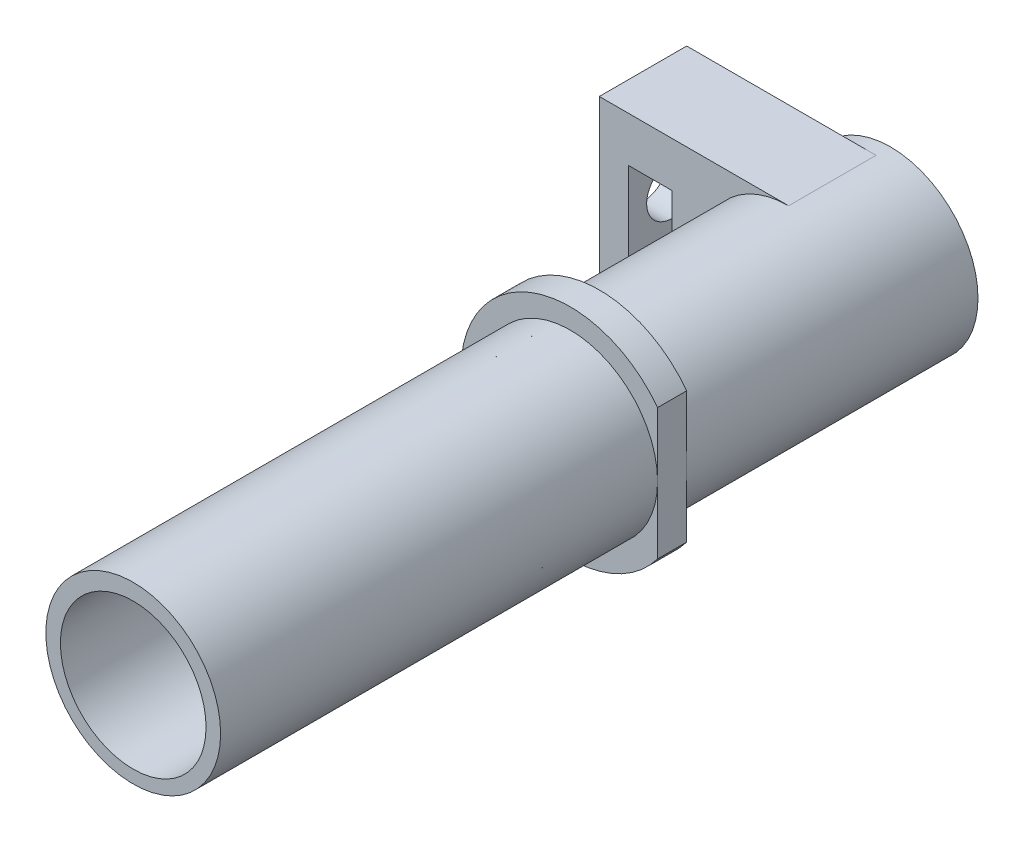
ISO-10303-21;
HEADER;
FILE_DESCRIPTION(('STEP AP214'),'2;1');
FILE_NAME('part.step','',(''),(''),'','','');
FILE_SCHEMA(('AUTOMOTIVE_DESIGN { 1 0 10303 214 1 1 1 1 }'));
ENDSEC;
DATA;
#1=APPLICATION_CONTEXT('core data for automotive mechanical design processes');
#2=APPLICATION_PROTOCOL_DEFINITION('international standard','automotive_design',2000,#1);
#3=PRODUCT_CONTEXT('',#1,'mechanical');
#4=PRODUCT('Part','Part','',(#3));
#5=PRODUCT_RELATED_PRODUCT_CATEGORY('part','',(#4));
#6=PRODUCT_DEFINITION_FORMATION('','',#4);
#7=PRODUCT_DEFINITION_CONTEXT('part definition',#1,'design');
#8=PRODUCT_DEFINITION('design','',#6,#7);
#9=PRODUCT_DEFINITION_SHAPE('','',#8);
#10=(LENGTH_UNIT() NAMED_UNIT(*) SI_UNIT(.MILLI.,.METRE.));
#11=(NAMED_UNIT(*) PLANE_ANGLE_UNIT() SI_UNIT($,.RADIAN.));
#12=(NAMED_UNIT(*) SI_UNIT($,.STERADIAN.) SOLID_ANGLE_UNIT());
#13=UNCERTAINTY_MEASURE_WITH_UNIT(LENGTH_MEASURE(1.E-05),#10,'distance_accuracy_value','');
#14=(GEOMETRIC_REPRESENTATION_CONTEXT(3) GLOBAL_UNCERTAINTY_ASSIGNED_CONTEXT((#13)) GLOBAL_UNIT_ASSIGNED_CONTEXT((#10,
#11,#12)) REPRESENTATION_CONTEXT('',''));
#15=CARTESIAN_POINT('',(0.,0.,0.));
#16=DIRECTION('',(0.,0.,1.));
#17=DIRECTION('',(1.,0.,0.));
#18=AXIS2_PLACEMENT_3D('',#15,#16,#17);
#19=CARTESIAN_POINT('',(3.,0.,-16.));
#20=DIRECTION('',(-1.,0.,0.));
#21=DIRECTION('',(0.,-1.,0.));
#22=AXIS2_PLACEMENT_3D('',#19,#20,#21);
#23=CYLINDRICAL_SURFACE('',#22,1.75);
#24=CARTESIAN_POINT('',(-11.,0.,-16.));
#25=DIRECTION('',(-1.,0.,0.));
#26=DIRECTION('',(0.,0.,1.));
#27=AXIS2_PLACEMENT_3D('',#24,#25,#26);
#28=CIRCLE('',#27,1.75);
#29=CARTESIAN_POINT('',(-11.,0.,-14.25));
#30=VERTEX_POINT('',#29);
#31=EDGE_CURVE('E44',#30,#30,#28,.F.);
#32=ORIENTED_EDGE('',*,*,#31,.T.);
#33=EDGE_LOOP('',(#32));
#34=FACE_BOUND('',#33,.T.);
#35=CARTESIAN_POINT('',(-13.,0.,-16.));
#36=DIRECTION('',(-1.,0.,0.));
#37=DIRECTION('',(0.,-1.,0.));
#38=AXIS2_PLACEMENT_3D('',#35,#36,#37);
#39=CIRCLE('',#38,1.75);
#40=CARTESIAN_POINT('',(-13.,-1.75,-16.));
#41=VERTEX_POINT('',#40);
#42=EDGE_CURVE('E168',#41,#41,#39,.T.);
#43=ORIENTED_EDGE('',*,*,#42,.T.);
#44=EDGE_LOOP('',(#43));
#45=FACE_BOUND('',#44,.T.);
#46=ADVANCED_FACE('F40',(#34,#45),#23,.F.);
#47=CARTESIAN_POINT('',(0.,0.,0.));
#48=DIRECTION('',(0.,0.,1.));
#49=DIRECTION('',(1.,0.,0.));
#50=AXIS2_PLACEMENT_3D('',#47,#48,#49);
#51=PLANE('',#50);
#52=CARTESIAN_POINT('',(0.,0.,0.));
#53=DIRECTION('',(0.,0.,1.));
#54=DIRECTION('',(1.,0.,0.));
#55=AXIS2_PLACEMENT_3D('',#52,#53,#54);
#56=CIRCLE('',#55,7.5);
#57=CARTESIAN_POINT('',(6.,4.5,0.));
#58=VERTEX_POINT('',#57);
#59=CARTESIAN_POINT('',(6.,-4.5,0.));
#60=VERTEX_POINT('',#59);
#61=EDGE_CURVE('E321',#58,#60,#56,.T.);
#62=ORIENTED_EDGE('',*,*,#61,.F.);
#63=DIRECTION('',(0.,1.,0.));
#64=VECTOR('',#63,1.);
#65=CARTESIAN_POINT('',(6.,4.5,0.));
#66=LINE('',#65,#64);
#67=CARTESIAN_POINT('',(6.,0.,0.));
#68=VERTEX_POINT('',#67);
#69=EDGE_CURVE('E289',#68,#58,#66,.T.);
#70=ORIENTED_EDGE('',*,*,#69,.F.);
#71=CARTESIAN_POINT('',(0.,0.,0.));
#72=DIRECTION('',(0.,0.,1.));
#73=DIRECTION('',(1.,0.,0.));
#74=AXIS2_PLACEMENT_3D('',#71,#72,#73);
#75=CIRCLE('',#74,6.);
#76=EDGE_CURVE('E11',#68,#68,#75,.F.);
#77=ORIENTED_EDGE('',*,*,#76,.F.);
#78=EDGE_CURVE('E290',#60,#68,#66,.T.);
#79=ORIENTED_EDGE('',*,*,#78,.F.);
#80=EDGE_LOOP('',(#62,#70,#77,#79));
#81=FACE_BOUND('',#80,.T.);
#82=ADVANCED_FACE('F236',(#81),#51,.F.);
#83=CARTESIAN_POINT('',(0.,0.,2.));
#84=DIRECTION('',(0.,0.,1.));
#85=DIRECTION('',(1.,0.,0.));
#86=AXIS2_PLACEMENT_3D('',#83,#84,#85);
#87=PLANE('',#86);
#88=DIRECTION('',(0.,-1.,0.));
#89=VECTOR('',#88,1.);
#90=CARTESIAN_POINT('',(6.,0.,2.));
#91=LINE('',#90,#89);
#92=CARTESIAN_POINT('',(6.,4.5,2.));
#93=VERTEX_POINT('',#92);
#94=CARTESIAN_POINT('',(6.,0.114284202410885,2.));
#95=VERTEX_POINT('',#94);
#96=EDGE_CURVE('E303',#93,#95,#91,.T.);
#97=ORIENTED_EDGE('',*,*,#96,.F.);
#98=CARTESIAN_POINT('',(0.,0.,2.));
#99=DIRECTION('',(0.,0.,1.));
#100=DIRECTION('',(1.,0.,0.));
#101=AXIS2_PLACEMENT_3D('',#98,#99,#100);
#102=CIRCLE('',#101,7.5);
#103=CARTESIAN_POINT('',(6.,-4.5,2.));
#104=VERTEX_POINT('',#103);
#105=EDGE_CURVE('E50',#93,#104,#102,.T.);
#106=ORIENTED_EDGE('',*,*,#105,.T.);
#107=EDGE_CURVE('E298',#95,#104,#91,.T.);
#108=ORIENTED_EDGE('',*,*,#107,.F.);
#109=CARTESIAN_POINT('',(0.,0.114284202410886,2.));
#110=DIRECTION('',(0.,0.,1.));
#111=DIRECTION('',(1.,0.,0.));
#112=AXIS2_PLACEMENT_3D('',#109,#110,#111);
#113=CIRCLE('',#112,6.);
#114=EDGE_CURVE('E316',#95,#95,#113,.T.);
#115=ORIENTED_EDGE('',*,*,#114,.F.);
#116=EDGE_LOOP('',(#97,#106,#108,#115));
#117=FACE_BOUND('',#116,.T.);
#118=ADVANCED_FACE('F241',(#117),#87,.T.);
#119=CARTESIAN_POINT('',(0.,0.,2.));
#120=DIRECTION('',(0.,0.,-1.));
#121=DIRECTION('',(-1.,0.,0.));
#122=AXIS2_PLACEMENT_3D('',#119,#120,#121);
#123=CYLINDRICAL_SURFACE('',#122,7.5);
#124=ORIENTED_EDGE('',*,*,#105,.F.);
#125=DIRECTION('',(0.,0.,-1.));
#126=VECTOR('',#125,1.);
#127=CARTESIAN_POINT('',(6.,4.5,32.));
#128=LINE('',#127,#126);
#129=EDGE_CURVE('E294',#93,#58,#128,.T.);
#130=ORIENTED_EDGE('',*,*,#129,.T.);
#131=ORIENTED_EDGE('',*,*,#61,.T.);
#132=DIRECTION('',(0.,0.,-1.));
#133=VECTOR('',#132,1.);
#134=CARTESIAN_POINT('',(6.,-4.5,32.));
#135=LINE('',#134,#133);
#136=EDGE_CURVE('E293',#104,#60,#135,.T.);
#137=ORIENTED_EDGE('',*,*,#136,.F.);
#138=EDGE_LOOP('',(#124,#130,#131,#137));
#139=FACE_BOUND('',#138,.T.);
#140=ADVANCED_FACE('F42',(#139),#123,.T.);
#141=CARTESIAN_POINT('',(0.,0.,2.));
#142=DIRECTION('',(0.,0.,-1.));
#143=DIRECTION('',(-1.,0.,0.));
#144=AXIS2_PLACEMENT_3D('',#141,#142,#143);
#145=CYLINDRICAL_SURFACE('',#144,5.);
#146=CARTESIAN_POINT('',(-5.,0.,-14.25));
#147=CARTESIAN_POINT('',(-5.00000103733101,-0.0952096828338517,-14.2499985216753));
#148=CARTESIAN_POINT('',(-4.99725598893572,-0.19040881080287,-14.2577948357027));
#149=CARTESIAN_POINT('',(-4.98657727125096,-0.377986679584454,-14.2886668965811));
#150=CARTESIAN_POINT('',(-4.97864357880525,-0.470365407808016,-14.3117427116226));
#151=CARTESIAN_POINT('',(-4.95844563461182,-0.649571178008045,-14.372274469251));
#152=CARTESIAN_POINT('',(-4.94618906431992,-0.736407746879042,-14.4097049148862));
#153=CARTESIAN_POINT('',(-4.91858449865725,-0.90256832264742,-14.497762555632));
#154=CARTESIAN_POINT('',(-4.90323580073971,-0.981890616231569,-14.5483927505616));
#155=CARTESIAN_POINT('',(-4.87040308680158,-1.13376294602663,-14.6634142578254));
#156=CARTESIAN_POINT('',(-4.85286420888526,-1.2059909823802,-14.7282149591112));
#157=CARTESIAN_POINT('',(-4.81791697471987,-1.3388059257563,-14.8688683344737));
#158=CARTESIAN_POINT('',(-4.80050865235984,-1.39938990436505,-14.9447237803435));
#159=CARTESIAN_POINT('',(-4.76717677106639,-1.50911478218042,-15.1083273247793));
#160=CARTESIAN_POINT('',(-4.75131928060129,-1.5578231653081,-15.1963802792296));
#161=CARTESIAN_POINT('',(-4.72372622172788,-1.63959966142256,-15.3800722951456));
#162=CARTESIAN_POINT('',(-4.71198924734498,-1.67267311059309,-15.475708755338));
#163=CARTESIAN_POINT('',(-4.69454718177247,-1.72100819663792,-15.6681715163408));
#164=CARTESIAN_POINT('',(-4.68863691368676,-1.73687783577275,-15.7648259485681));
#165=CARTESIAN_POINT('',(-4.68291285938438,-1.75225598886936,-15.9595925594599));
#166=CARTESIAN_POINT('',(-4.68309695465922,-1.75177018827031,-16.057704219712));
#167=CARTESIAN_POINT('',(-4.68936213420266,-1.73492049950347,-16.2472747294413));
#168=CARTESIAN_POINT('',(-4.69514165218839,-1.71936857551242,-16.3388174901404));
#169=CARTESIAN_POINT('',(-4.71145002275453,-1.67415954156167,-16.5179012031455));
#170=CARTESIAN_POINT('',(-4.72197949914485,-1.64450057890303,-16.6054416281629));
#171=CARTESIAN_POINT('',(-4.74680305355679,-1.57142185546169,-16.7758061833894));
#172=CARTESIAN_POINT('',(-4.76115899627831,-1.52777332723189,-16.8585227756742));
#173=CARTESIAN_POINT('',(-4.79199406442834,-1.4281134425151,-17.0157059744924));
#174=CARTESIAN_POINT('',(-4.80847385131419,-1.37209823061347,-17.090169997322));
#175=CARTESIAN_POINT('',(-4.84286620656224,-1.24546699759313,-17.2332716141847));
#176=CARTESIAN_POINT('',(-4.86080646622104,-1.17419303921033,-17.3013216247744));
#177=CARTESIAN_POINT('',(-4.8952687040212,-1.0210284236278,-17.4246649359445));
#178=CARTESIAN_POINT('',(-4.91179051664925,-0.939136530251654,-17.4799567490853));
#179=CARTESIAN_POINT('',(-4.94181156683104,-0.765717364559243,-17.5767529956271));
#180=CARTESIAN_POINT('',(-4.95527243997278,-0.674086901705204,-17.6180852812226));
#181=CARTESIAN_POINT('',(-4.97737441176816,-0.484587571487144,-17.6845611534333));
#182=CARTESIAN_POINT('',(-4.98601736398459,-0.386721119418453,-17.7097109663858));
#183=CARTESIAN_POINT('',(-4.99719530081429,-0.19249102184071,-17.7420329067109));
#184=CARTESIAN_POINT('',(-4.99999944582713,-0.0962746493135024,-17.7499979032595));
#185=CARTESIAN_POINT('',(-5.00000055348245,0.0961482432192141,-17.750002094671));
#186=CARTESIAN_POINT('',(-4.99719857404261,0.192354761658124,-17.7420442942851));
#187=CARTESIAN_POINT('',(-4.98648016160199,0.378756147356785,-17.7110473250482));
#188=CARTESIAN_POINT('',(-4.97873315412155,0.469044763699439,-17.6885074311332));
#189=CARTESIAN_POINT('',(-4.95907295054626,0.64451252208843,-17.6296230925497));
#190=CARTESIAN_POINT('',(-4.94715921538899,0.729691001349328,-17.5932768616604));
#191=CARTESIAN_POINT('',(-4.91995212643839,0.895153397302998,-17.5067049556843));
#192=CARTESIAN_POINT('',(-4.90457436715764,0.975236620637246,-17.4561230076482));
#193=CARTESIAN_POINT('',(-4.87216758733509,1.12602889379182,-17.3429274102134));
#194=CARTESIAN_POINT('',(-4.85513801945205,1.19673481786299,-17.280309765888));
#195=CARTESIAN_POINT('',(-4.82025419862104,1.33047657690196,-17.141099899193));
#196=CARTESIAN_POINT('',(-4.80240157790623,1.39294725580895,-17.0639629460116));
#197=CARTESIAN_POINT('',(-4.76874589345347,1.50414371312864,-16.8999270503001));
#198=CARTESIAN_POINT('',(-4.75294290163694,1.55286900928668,-16.8130277654096));
#199=CARTESIAN_POINT('',(-4.72530277474736,1.63505490739624,-16.6316663548963));
#200=CARTESIAN_POINT('',(-4.71346572039381,1.66851519866113,-16.5372040753908));
#201=CARTESIAN_POINT('',(-4.69533771032375,1.71887583093725,-16.3434672730568));
#202=CARTESIAN_POINT('',(-4.68904390901757,1.73578466901695,-16.2441952469234));
#203=CARTESIAN_POINT('',(-4.68306030518287,1.75185969647853,-16.0496898392289));
#204=CARTESIAN_POINT('',(-4.68301773400572,1.7519736539037,-15.9545448516573));
#205=CARTESIAN_POINT('',(-4.68865663417064,1.73682550011427,-15.7656686884212));
#206=CARTESIAN_POINT('',(-4.69433769425176,1.72156449363927,-15.6719374116682));
#207=CARTESIAN_POINT('',(-4.71050847004451,1.67679826569238,-15.4907245206286));
#208=CARTESIAN_POINT('',(-4.72088397271024,1.64763052861044,-15.4031485166598));
#209=CARTESIAN_POINT('',(-4.74522244831082,1.57616059789321,-15.2340709525965));
#210=CARTESIAN_POINT('',(-4.7591862653351,1.53385531338635,-15.1525708275759));
#211=CARTESIAN_POINT('',(-4.78994937845571,1.43498510349303,-14.9937827123039));
#212=CARTESIAN_POINT('',(-4.80685142496673,1.37784120361852,-14.9168752998993));
#213=CARTESIAN_POINT('',(-4.84118780733322,1.25186200567032,-14.7734361856582));
#214=CARTESIAN_POINT('',(-4.85862229965653,1.18302324322024,-14.706907569574));
#215=CARTESIAN_POINT('',(-4.8929933476359,1.0319265825184,-14.583108109143));
#216=CARTESIAN_POINT('',(-4.90987297784856,0.949206989314116,-14.5263827747453));
#217=CARTESIAN_POINT('',(-4.94039013085785,0.774833814541663,-14.4276882523602));
#218=CARTESIAN_POINT('',(-4.95402808296839,0.683181418264973,-14.3857171100381));
#219=CARTESIAN_POINT('',(-4.97638140508249,0.4945149188633,-14.3183713904794));
#220=CARTESIAN_POINT('',(-4.9851485754033,0.397569773126585,-14.292821695715));
#221=CARTESIAN_POINT('',(-4.9969563185802,0.200411745802667,-14.2586397574974));
#222=CARTESIAN_POINT('',(-4.99999890829805,0.100200027745055,-14.25000155581));
#223=CARTESIAN_POINT('',(-5.,0.,-14.25));
#224=B_SPLINE_CURVE_WITH_KNOTS('',3,(#146,#147,#148,#149,#150,#151,#152,#153,#154,#155,#156,
#157,#158,#159,#160,#161,#162,#163,#164,#165,#166,#167,#168,#169,#170,#171,#172,#173,#174,#175,
#176,#177,#178,#179,#180,#181,#182,#183,#184,#185,#186,#187,#188,#189,#190,#191,#192,#193,#194,
#195,#196,#197,#198,#199,#200,#201,#202,#203,#204,#205,#206,#207,#208,#209,#210,#211,#212,#213,
#214,#215,#216,#217,#218,#219,#220,#221,#222,#223),.UNSPECIFIED.,.T.,.F.,(4,2,2,2,2,2,2,2,2,2,2,
2,2,2,2,2,2,2,2,2,2,2,2,2,2,2,2,2,2,2,2,2,2,2,2,2,2,2,4),(0.,0.285259972015709,
0.570521217118272,0.855278105441005,1.14009976506063,1.43460645051474,1.72918710607093,
2.03327692240217,2.33726287818893,2.63011516958154,2.92286566140676,3.20066900267533,
3.4785088383591,3.76114618999298,4.0438717808712,4.34297890688594,4.64212088729939,
4.94482757119952,5.24741771649683,5.535718777151,5.82396543836598,6.10283068551592,
6.38173202367696,6.66835188854305,6.95506705399024,7.25621287816636,7.55736926668414,
7.85853178432477,8.15953961206051,8.44355407895973,8.7275481399799,9.0049762467923,
9.28246967364509,9.57306535444324,9.86374726916317,10.1673989020176,10.4710102981225,
10.7713277865075,11.0715394483866),.UNSPECIFIED.);
#225=CARTESIAN_POINT('',(-5.,0.,-14.25));
#226=VERTEX_POINT('',#225);
#227=EDGE_CURVE('E172',#226,#226,#224,.T.);
#228=ORIENTED_EDGE('',*,*,#227,.F.);
#229=EDGE_LOOP('',(#228));
#230=FACE_BOUND('',#229,.T.);
#231=CARTESIAN_POINT('',(0.,0.,32.));
#232=DIRECTION('',(0.,0.,1.));
#233=DIRECTION('',(1.,0.,0.));
#234=AXIS2_PLACEMENT_3D('',#231,#232,#233);
#235=CIRCLE('',#234,5.);
#236=CARTESIAN_POINT('',(5.,0.,32.));
#237=VERTEX_POINT('',#236);
#238=EDGE_CURVE('E312',#237,#237,#235,.T.);
#239=ORIENTED_EDGE('',*,*,#238,.T.);
#240=EDGE_LOOP('',(#239));
#241=FACE_BOUND('',#240,.T.);
#242=CARTESIAN_POINT('',(0.,0.,-20.));
#243=DIRECTION('',(0.,0.,-1.));
#244=DIRECTION('',(-1.,0.,0.));
#245=AXIS2_PLACEMENT_3D('',#242,#243,#244);
#246=CIRCLE('',#245,5.);
#247=CARTESIAN_POINT('',(-5.,0.,-20.));
#248=VERTEX_POINT('',#247);
#249=EDGE_CURVE('E304',#248,#248,#246,.T.);
#250=ORIENTED_EDGE('',*,*,#249,.T.);
#251=EDGE_LOOP('',(#250));
#252=FACE_BOUND('',#251,.T.);
#253=ADVANCED_FACE('F183',(#230,#241,#252),#145,.F.);
#254=CARTESIAN_POINT('',(0.,0.114284202410886,32.));
#255=DIRECTION('',(0.,0.,1.));
#256=DIRECTION('',(1.,0.,0.));
#257=AXIS2_PLACEMENT_3D('',#254,#255,#256);
#258=PLANE('',#257);
#259=CARTESIAN_POINT('',(0.,0.114284202410886,32.));
#260=DIRECTION('',(0.,0.,1.));
#261=DIRECTION('',(1.,0.,0.));
#262=AXIS2_PLACEMENT_3D('',#259,#260,#261);
#263=CIRCLE('',#262,6.);
#264=CARTESIAN_POINT('',(6.,0.114284202410886,32.));
#265=VERTEX_POINT('',#264);
#266=EDGE_CURVE('E317',#265,#265,#263,.T.);
#267=ORIENTED_EDGE('',*,*,#266,.T.);
#268=EDGE_LOOP('',(#267));
#269=FACE_BOUND('',#268,.T.);
#270=ORIENTED_EDGE('',*,*,#238,.F.);
#271=EDGE_LOOP('',(#270));
#272=FACE_BOUND('',#271,.T.);
#273=ADVANCED_FACE('F226',(#269,#272),#258,.T.);
#274=CARTESIAN_POINT('',(0.,0.114284202410886,32.));
#275=DIRECTION('',(0.,0.,-1.));
#276=DIRECTION('',(-1.,0.,0.));
#277=AXIS2_PLACEMENT_3D('',#274,#275,#276);
#278=CYLINDRICAL_SURFACE('',#277,6.);
#279=ORIENTED_EDGE('',*,*,#114,.T.);
#280=EDGE_LOOP('',(#279));
#281=FACE_BOUND('',#280,.T.);
#282=ORIENTED_EDGE('',*,*,#266,.F.);
#283=EDGE_LOOP('',(#282));
#284=FACE_BOUND('',#283,.T.);
#285=ADVANCED_FACE('F221',(#281,#284),#278,.T.);
#286=CARTESIAN_POINT('',(0.,0.,-20.));
#287=DIRECTION('',(0.,0.,-1.));
#288=DIRECTION('',(-1.,0.,0.));
#289=AXIS2_PLACEMENT_3D('',#286,#287,#288);
#290=PLANE('',#289);
#291=CARTESIAN_POINT('',(0.,0.,-20.));
#292=DIRECTION('',(0.,0.,-1.));
#293=DIRECTION('',(-1.,0.,0.));
#294=AXIS2_PLACEMENT_3D('',#291,#292,#293);
#295=CIRCLE('',#294,6.);
#296=CARTESIAN_POINT('',(-6.,0.,-20.));
#297=VERTEX_POINT('',#296);
#298=EDGE_CURVE('E308',#297,#297,#295,.T.);
#299=ORIENTED_EDGE('',*,*,#298,.T.);
#300=EDGE_LOOP('',(#299));
#301=FACE_BOUND('',#300,.T.);
#302=ORIENTED_EDGE('',*,*,#249,.F.);
#303=EDGE_LOOP('',(#302));
#304=FACE_BOUND('',#303,.T.);
#305=ADVANCED_FACE('F218',(#301,#304),#290,.T.);
#306=CARTESIAN_POINT('',(0.,0.,-20.));
#307=DIRECTION('',(0.,0.,1.));
#308=DIRECTION('',(1.,0.,0.));
#309=AXIS2_PLACEMENT_3D('',#306,#307,#308);
#310=CYLINDRICAL_SURFACE('',#309,6.);
#311=DIRECTION('',(0.,0.,1.));
#312=VECTOR('',#311,1.);
#313=CARTESIAN_POINT('',(0.,-6.,-19.));
#314=LINE('',#313,#312);
#315=CARTESIAN_POINT('',(0.,-6.,-19.));
#316=VERTEX_POINT('',#315);
#317=CARTESIAN_POINT('',(0.,-6.,-13.));
#318=VERTEX_POINT('',#317);
#319=EDGE_CURVE('E285',#316,#318,#314,.T.);
#320=ORIENTED_EDGE('',*,*,#319,.F.);
#321=CARTESIAN_POINT('',(0.,0.,-19.));
#322=DIRECTION('',(0.,0.,1.));
#323=DIRECTION('',(-1.,0.,0.));
#324=AXIS2_PLACEMENT_3D('',#321,#322,#323);
#325=CIRCLE('',#324,6.);
#326=CARTESIAN_POINT('',(0.,6.,-19.));
#327=VERTEX_POINT('',#326);
#328=EDGE_CURVE('E181',#327,#316,#325,.T.);
#329=ORIENTED_EDGE('',*,*,#328,.F.);
#330=DIRECTION('',(0.,0.,1.));
#331=VECTOR('',#330,1.);
#332=CARTESIAN_POINT('',(0.,6.,-19.));
#333=LINE('',#332,#331);
#334=CARTESIAN_POINT('',(0.,6.,-13.));
#335=VERTEX_POINT('',#334);
#336=EDGE_CURVE('E271',#327,#335,#333,.T.);
#337=ORIENTED_EDGE('',*,*,#336,.T.);
#338=CARTESIAN_POINT('',(0.,0.,-13.));
#339=DIRECTION('',(0.,0.,1.));
#340=DIRECTION('',(-1.,0.,0.));
#341=AXIS2_PLACEMENT_3D('',#338,#339,#340);
#342=CIRCLE('',#341,6.);
#343=EDGE_CURVE('E180',#335,#318,#342,.T.);
#344=ORIENTED_EDGE('',*,*,#343,.T.);
#345=EDGE_LOOP('',(#320,#329,#337,#344));
#346=FACE_BOUND('',#345,.T.);
#347=ORIENTED_EDGE('',*,*,#298,.F.);
#348=EDGE_LOOP('',(#347));
#349=FACE_BOUND('',#348,.T.);
#350=ORIENTED_EDGE('',*,*,#76,.T.);
#351=EDGE_LOOP('',(#350));
#352=FACE_BOUND('',#351,.T.);
#353=ADVANCED_FACE('F216',(#346,#349,#352),#310,.T.);
#354=CARTESIAN_POINT('',(6.,4.5,32.));
#355=DIRECTION('',(-1.,0.,0.));
#356=DIRECTION('',(0.,-1.,0.));
#357=AXIS2_PLACEMENT_3D('',#354,#355,#356);
#358=PLANE('',#357);
#359=ORIENTED_EDGE('',*,*,#96,.T.);
#360=ORIENTED_EDGE('',*,*,#107,.T.);
#361=ORIENTED_EDGE('',*,*,#136,.T.);
#362=ORIENTED_EDGE('',*,*,#78,.T.);
#363=ORIENTED_EDGE('',*,*,#69,.T.);
#364=ORIENTED_EDGE('',*,*,#129,.F.);
#365=EDGE_LOOP('',(#359,#360,#361,#362,#363,#364));
#366=FACE_BOUND('',#365,.T.);
#367=ADVANCED_FACE('F212',(#366),#358,.F.);
#368=CARTESIAN_POINT('',(-13.,-6.,-19.));
#369=DIRECTION('',(0.,1.,0.));
#370=DIRECTION('',(-1.,0.,0.));
#371=AXIS2_PLACEMENT_3D('',#368,#369,#370);
#372=PLANE('',#371);
#373=DIRECTION('',(-1.,0.,0.));
#374=VECTOR('',#373,1.);
#375=CARTESIAN_POINT('',(-13.,-6.,-13.));
#376=LINE('',#375,#374);
#377=CARTESIAN_POINT('',(-13.,-6.,-13.));
#378=VERTEX_POINT('',#377);
#379=EDGE_CURVE('E263',#318,#378,#376,.T.);
#380=ORIENTED_EDGE('',*,*,#379,.T.);
#381=DIRECTION('',(0.,0.,1.));
#382=VECTOR('',#381,1.);
#383=CARTESIAN_POINT('',(-13.,-6.,-19.));
#384=LINE('',#383,#382);
#385=CARTESIAN_POINT('',(-13.,-6.,-19.));
#386=VERTEX_POINT('',#385);
#387=EDGE_CURVE('E257',#386,#378,#384,.T.);
#388=ORIENTED_EDGE('',*,*,#387,.F.);
#389=DIRECTION('',(-1.,0.,0.));
#390=VECTOR('',#389,1.);
#391=CARTESIAN_POINT('',(-13.,-6.,-19.));
#392=LINE('',#391,#390);
#393=EDGE_CURVE('E278',#316,#386,#392,.T.);
#394=ORIENTED_EDGE('',*,*,#393,.F.);
#395=ORIENTED_EDGE('',*,*,#319,.T.);
#396=EDGE_LOOP('',(#380,#388,#394,#395));
#397=FACE_BOUND('',#396,.T.);
#398=ADVANCED_FACE('F208',(#397),#372,.F.);
#399=CARTESIAN_POINT('',(-13.,6.,-19.));
#400=DIRECTION('',(1.,0.,0.));
#401=DIRECTION('',(0.,1.,0.));
#402=AXIS2_PLACEMENT_3D('',#399,#400,#401);
#403=PLANE('',#402);
#404=ORIENTED_EDGE('',*,*,#42,.F.);
#405=EDGE_LOOP('',(#404));
#406=FACE_BOUND('',#405,.T.);
#407=DIRECTION('',(0.,1.,0.));
#408=VECTOR('',#407,1.);
#409=CARTESIAN_POINT('',(-13.,6.,-13.));
#410=LINE('',#409,#408);
#411=CARTESIAN_POINT('',(-13.,6.,-13.));
#412=VERTEX_POINT('',#411);
#413=EDGE_CURVE('E251',#378,#412,#410,.T.);
#414=ORIENTED_EDGE('',*,*,#413,.T.);
#415=DIRECTION('',(0.,0.,1.));
#416=VECTOR('',#415,1.);
#417=CARTESIAN_POINT('',(-13.,6.,-19.));
#418=LINE('',#417,#416);
#419=CARTESIAN_POINT('',(-13.,6.,-19.));
#420=VERTEX_POINT('',#419);
#421=EDGE_CURVE('E254',#420,#412,#418,.T.);
#422=ORIENTED_EDGE('',*,*,#421,.F.);
#423=DIRECTION('',(0.,1.,0.));
#424=VECTOR('',#423,1.);
#425=CARTESIAN_POINT('',(-13.,6.,-19.));
#426=LINE('',#425,#424);
#427=EDGE_CURVE('E360',#386,#420,#426,.T.);
#428=ORIENTED_EDGE('',*,*,#427,.F.);
#429=ORIENTED_EDGE('',*,*,#387,.T.);
#430=EDGE_LOOP('',(#414,#422,#428,#429));
#431=FACE_BOUND('',#430,.T.);
#432=ADVANCED_FACE('F204',(#406,#431),#403,.F.);
#433=CARTESIAN_POINT('',(0.,6.,-19.));
#434=DIRECTION('',(0.,-1.,0.));
#435=DIRECTION('',(0.,0.,-1.));
#436=AXIS2_PLACEMENT_3D('',#433,#434,#435);
#437=PLANE('',#436);
#438=DIRECTION('',(1.,0.,0.));
#439=VECTOR('',#438,1.);
#440=CARTESIAN_POINT('',(0.,6.,-13.));
#441=LINE('',#440,#439);
#442=EDGE_CURVE('E262',#412,#335,#441,.T.);
#443=ORIENTED_EDGE('',*,*,#442,.T.);
#444=ORIENTED_EDGE('',*,*,#336,.F.);
#445=DIRECTION('',(1.,0.,0.));
#446=VECTOR('',#445,1.);
#447=CARTESIAN_POINT('',(0.,6.,-19.));
#448=LINE('',#447,#446);
#449=EDGE_CURVE('E269',#420,#327,#448,.T.);
#450=ORIENTED_EDGE('',*,*,#449,.F.);
#451=ORIENTED_EDGE('',*,*,#421,.T.);
#452=EDGE_LOOP('',(#443,#444,#450,#451));
#453=FACE_BOUND('',#452,.T.);
#454=ADVANCED_FACE('F198',(#453),#437,.F.);
#455=CARTESIAN_POINT('',(0.,0.,-19.));
#456=DIRECTION('',(0.,0.,-1.));
#457=DIRECTION('',(-1.,0.,0.));
#458=AXIS2_PLACEMENT_3D('',#455,#456,#457);
#459=PLANE('',#458);
#460=DIRECTION('',(0.,1.,0.));
#461=VECTOR('',#460,1.);
#462=CARTESIAN_POINT('',(-11.,2.9,-19.));
#463=LINE('',#462,#461);
#464=CARTESIAN_POINT('',(-11.,-2.9,-19.));
#465=VERTEX_POINT('',#464);
#466=CARTESIAN_POINT('',(-11.,2.9,-19.));
#467=VERTEX_POINT('',#466);
#468=EDGE_CURVE('E58',#465,#467,#463,.T.);
#469=ORIENTED_EDGE('',*,*,#468,.F.);
#470=DIRECTION('',(-1.,0.,0.));
#471=VECTOR('',#470,1.);
#472=CARTESIAN_POINT('',(-8.,-2.9,-19.));
#473=LINE('',#472,#471);
#474=CARTESIAN_POINT('',(-8.,-2.9,-19.));
#475=VERTEX_POINT('',#474);
#476=EDGE_CURVE('E148',#475,#465,#473,.T.);
#477=ORIENTED_EDGE('',*,*,#476,.F.);
#478=DIRECTION('',(0.,-1.,0.));
#479=VECTOR('',#478,1.);
#480=CARTESIAN_POINT('',(-8.,2.9,-19.));
#481=LINE('',#480,#479);
#482=CARTESIAN_POINT('',(-8.,2.9,-19.));
#483=VERTEX_POINT('',#482);
#484=EDGE_CURVE('E130',#483,#475,#481,.T.);
#485=ORIENTED_EDGE('',*,*,#484,.F.);
#486=DIRECTION('',(1.,0.,0.));
#487=VECTOR('',#486,1.);
#488=CARTESIAN_POINT('',(-8.,2.9,-19.));
#489=LINE('',#488,#487);
#490=EDGE_CURVE('E140',#467,#483,#489,.T.);
#491=ORIENTED_EDGE('',*,*,#490,.F.);
#492=EDGE_LOOP('',(#469,#477,#485,#491));
#493=FACE_BOUND('',#492,.T.);
#494=ORIENTED_EDGE('',*,*,#328,.T.);
#495=ORIENTED_EDGE('',*,*,#393,.T.);
#496=ORIENTED_EDGE('',*,*,#427,.T.);
#497=ORIENTED_EDGE('',*,*,#449,.T.);
#498=EDGE_LOOP('',(#494,#495,#496,#497));
#499=FACE_BOUND('',#498,.T.);
#500=ADVANCED_FACE('F145',(#493,#499),#459,.T.);
#501=CARTESIAN_POINT('',(0.,0.,-13.));
#502=DIRECTION('',(0.,0.,-1.));
#503=DIRECTION('',(-1.,0.,0.));
#504=AXIS2_PLACEMENT_3D('',#501,#502,#503);
#505=PLANE('',#504);
#506=DIRECTION('',(1.,0.,0.));
#507=VECTOR('',#506,1.);
#508=CARTESIAN_POINT('',(-8.,-2.9,-13.));
#509=LINE('',#508,#507);
#510=CARTESIAN_POINT('',(-11.,-2.9,-13.));
#511=VERTEX_POINT('',#510);
#512=CARTESIAN_POINT('',(-8.,-2.9,-13.));
#513=VERTEX_POINT('',#512);
#514=EDGE_CURVE('E604',#511,#513,#509,.T.);
#515=ORIENTED_EDGE('',*,*,#514,.F.);
#516=DIRECTION('',(0.,-1.,0.));
#517=VECTOR('',#516,1.);
#518=CARTESIAN_POINT('',(-11.,2.9,-13.));
#519=LINE('',#518,#517);
#520=CARTESIAN_POINT('',(-11.,2.9,-13.));
#521=VERTEX_POINT('',#520);
#522=EDGE_CURVE('E167',#521,#511,#519,.T.);
#523=ORIENTED_EDGE('',*,*,#522,.F.);
#524=DIRECTION('',(-1.,0.,0.));
#525=VECTOR('',#524,1.);
#526=CARTESIAN_POINT('',(-8.,2.9,-13.));
#527=LINE('',#526,#525);
#528=CARTESIAN_POINT('',(-8.,2.9,-13.));
#529=VERTEX_POINT('',#528);
#530=EDGE_CURVE('E163',#529,#521,#527,.T.);
#531=ORIENTED_EDGE('',*,*,#530,.F.);
#532=DIRECTION('',(0.,1.,0.));
#533=VECTOR('',#532,1.);
#534=CARTESIAN_POINT('',(-8.,2.9,-13.));
#535=LINE('',#534,#533);
#536=EDGE_CURVE('E133',#513,#529,#535,.T.);
#537=ORIENTED_EDGE('',*,*,#536,.F.);
#538=EDGE_LOOP('',(#515,#523,#531,#537));
#539=FACE_BOUND('',#538,.T.);
#540=ORIENTED_EDGE('',*,*,#343,.F.);
#541=ORIENTED_EDGE('',*,*,#442,.F.);
#542=ORIENTED_EDGE('',*,*,#413,.F.);
#543=ORIENTED_EDGE('',*,*,#379,.F.);
#544=EDGE_LOOP('',(#540,#541,#542,#543));
#545=FACE_BOUND('',#544,.T.);
#546=ADVANCED_FACE('F193',(#539,#545),#505,.F.);
#547=CARTESIAN_POINT('',(-8.,0.,-16.));
#548=DIRECTION('',(1.,0.,0.));
#549=DIRECTION('',(0.,0.,-1.));
#550=AXIS2_PLACEMENT_3D('',#547,#548,#549);
#551=CIRCLE('',#550,1.75);
#552=CARTESIAN_POINT('',(-8.,0.,-17.75));
#553=VERTEX_POINT('',#552);
#554=EDGE_CURVE('E166',#553,#553,#551,.F.);
#555=ORIENTED_EDGE('',*,*,#554,.T.);
#556=EDGE_LOOP('',(#555));
#557=FACE_BOUND('',#556,.T.);
#558=ORIENTED_EDGE('',*,*,#227,.T.);
#559=EDGE_LOOP('',(#558));
#560=FACE_BOUND('',#559,.T.);
#561=ADVANCED_FACE('F187',(#557,#560),#23,.F.);
#562=CARTESIAN_POINT('',(-11.,2.9,-6.4700689130742));
#563=DIRECTION('',(-1.,0.,0.));
#564=DIRECTION('',(0.,0.,1.));
#565=AXIS2_PLACEMENT_3D('',#562,#563,#564);
#566=PLANE('',#565);
#567=ORIENTED_EDGE('',*,*,#522,.T.);
#568=DIRECTION('',(0.,0.,-1.));
#569=VECTOR('',#568,1.);
#570=CARTESIAN_POINT('',(-11.,-2.9,-6.4700689130742));
#571=LINE('',#570,#569);
#572=EDGE_CURVE('E156',#511,#465,#571,.T.);
#573=ORIENTED_EDGE('',*,*,#572,.T.);
#574=ORIENTED_EDGE('',*,*,#468,.T.);
#575=DIRECTION('',(0.,0.,-1.));
#576=VECTOR('',#575,1.);
#577=CARTESIAN_POINT('',(-11.,2.9,-6.4700689130742));
#578=LINE('',#577,#576);
#579=EDGE_CURVE('E137',#521,#467,#578,.T.);
#580=ORIENTED_EDGE('',*,*,#579,.F.);
#581=EDGE_LOOP('',(#567,#573,#574,#580));
#582=FACE_BOUND('',#581,.T.);
#583=ORIENTED_EDGE('',*,*,#31,.F.);
#584=EDGE_LOOP('',(#583));
#585=FACE_BOUND('',#584,.T.);
#586=ADVANCED_FACE('F192',(#582,#585),#566,.F.);
#587=CARTESIAN_POINT('',(-8.,2.9,-6.4700689130742));
#588=DIRECTION('',(1.,0.,0.));
#589=DIRECTION('',(0.,0.,-1.));
#590=AXIS2_PLACEMENT_3D('',#587,#588,#589);
#591=PLANE('',#590);
#592=ORIENTED_EDGE('',*,*,#536,.T.);
#593=DIRECTION('',(0.,0.,-1.));
#594=VECTOR('',#593,1.);
#595=CARTESIAN_POINT('',(-8.,2.9,-6.4700689130742));
#596=LINE('',#595,#594);
#597=EDGE_CURVE('E66',#529,#483,#596,.T.);
#598=ORIENTED_EDGE('',*,*,#597,.T.);
#599=ORIENTED_EDGE('',*,*,#484,.T.);
#600=DIRECTION('',(0.,0.,-1.));
#601=VECTOR('',#600,1.);
#602=CARTESIAN_POINT('',(-8.,-2.9,-6.4700689130742));
#603=LINE('',#602,#601);
#604=EDGE_CURVE('E136',#513,#475,#603,.T.);
#605=ORIENTED_EDGE('',*,*,#604,.F.);
#606=EDGE_LOOP('',(#592,#598,#599,#605));
#607=FACE_BOUND('',#606,.T.);
#608=ORIENTED_EDGE('',*,*,#554,.F.);
#609=EDGE_LOOP('',(#608));
#610=FACE_BOUND('',#609,.T.);
#611=ADVANCED_FACE('F126',(#607,#610),#591,.F.);
#612=CARTESIAN_POINT('',(-8.,-2.9,-6.4700689130742));
#613=DIRECTION('',(0.,-1.,0.));
#614=DIRECTION('',(0.,0.,-1.));
#615=AXIS2_PLACEMENT_3D('',#612,#613,#614);
#616=PLANE('',#615);
#617=ORIENTED_EDGE('',*,*,#514,.T.);
#618=ORIENTED_EDGE('',*,*,#604,.T.);
#619=ORIENTED_EDGE('',*,*,#476,.T.);
#620=ORIENTED_EDGE('',*,*,#572,.F.);
#621=EDGE_LOOP('',(#617,#618,#619,#620));
#622=FACE_BOUND('',#621,.T.);
#623=ADVANCED_FACE('F571',(#622),#616,.F.);
#624=CARTESIAN_POINT('',(-8.,2.9,-6.4700689130742));
#625=DIRECTION('',(0.,1.,0.));
#626=DIRECTION('',(0.,0.,1.));
#627=AXIS2_PLACEMENT_3D('',#624,#625,#626);
#628=PLANE('',#627);
#629=ORIENTED_EDGE('',*,*,#530,.T.);
#630=ORIENTED_EDGE('',*,*,#579,.T.);
#631=ORIENTED_EDGE('',*,*,#490,.T.);
#632=ORIENTED_EDGE('',*,*,#597,.F.);
#633=EDGE_LOOP('',(#629,#630,#631,#632));
#634=FACE_BOUND('',#633,.T.);
#635=ADVANCED_FACE('F141',(#634),#628,.F.);
#636=CLOSED_SHELL('',(#46,#82,#118,#140,#253,#273,#285,#305,#353,#367,#398,#432,#454,#500,#546,
#561,#586,#611,#623,#635));
#637=MANIFOLD_SOLID_BREP('B2',#636);
#638=ADVANCED_BREP_SHAPE_REPRESENTATION('',(#18,#637),#14);
#639=SHAPE_DEFINITION_REPRESENTATION(#9,#638);
ENDSEC;
END-ISO-10303-21;
